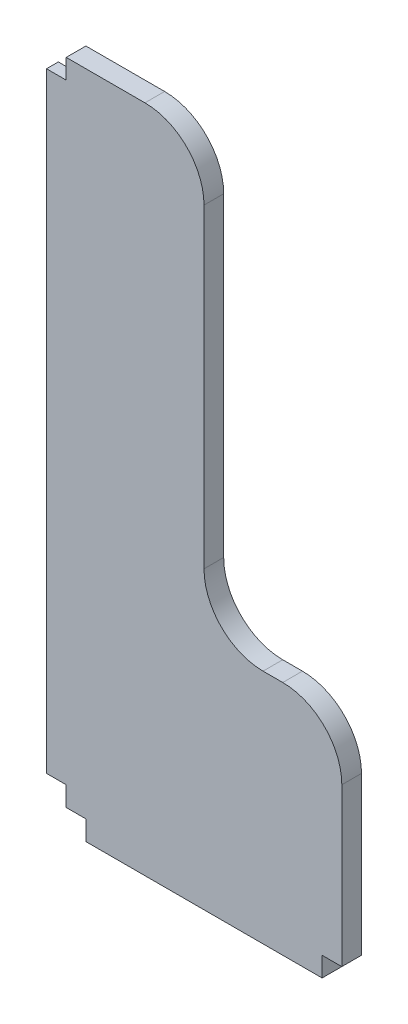
ISO-10303-21;
HEADER;
FILE_DESCRIPTION(('STEP AP214'),'2;1');
FILE_NAME('part.step','',(''),(''),'','','');
FILE_SCHEMA(('AUTOMOTIVE_DESIGN { 1 0 10303 214 1 1 1 1 }'));
ENDSEC;
DATA;
#1=APPLICATION_CONTEXT('core data for automotive mechanical design processes');
#2=APPLICATION_PROTOCOL_DEFINITION('international standard','automotive_design',2000,#1);
#3=PRODUCT_CONTEXT('',#1,'mechanical');
#4=PRODUCT('Part','Part','',(#3));
#5=PRODUCT_RELATED_PRODUCT_CATEGORY('part','',(#4));
#6=PRODUCT_DEFINITION_FORMATION('','',#4);
#7=PRODUCT_DEFINITION_CONTEXT('part definition',#1,'design');
#8=PRODUCT_DEFINITION('design','',#6,#7);
#9=PRODUCT_DEFINITION_SHAPE('','',#8);
#10=(LENGTH_UNIT() NAMED_UNIT(*) SI_UNIT(.MILLI.,.METRE.));
#11=(NAMED_UNIT(*) PLANE_ANGLE_UNIT() SI_UNIT($,.RADIAN.));
#12=(NAMED_UNIT(*) SI_UNIT($,.STERADIAN.) SOLID_ANGLE_UNIT());
#13=UNCERTAINTY_MEASURE_WITH_UNIT(LENGTH_MEASURE(1.E-05),#10,'distance_accuracy_value','');
#14=(GEOMETRIC_REPRESENTATION_CONTEXT(3) GLOBAL_UNCERTAINTY_ASSIGNED_CONTEXT((#13)) GLOBAL_UNIT_ASSIGNED_CONTEXT((#10,
#11,#12)) REPRESENTATION_CONTEXT('',''));
#15=CARTESIAN_POINT('',(0.,0.,0.));
#16=DIRECTION('',(0.,0.,1.));
#17=DIRECTION('',(1.,0.,0.));
#18=AXIS2_PLACEMENT_3D('',#15,#16,#17);
#19=CARTESIAN_POINT('',(25.4,190.5,0.));
#20=DIRECTION('',(0.,0.,-1.));
#21=DIRECTION('',(-1.,0.,0.));
#22=AXIS2_PLACEMENT_3D('',#19,#20,#21);
#23=PLANE('',#22);
#24=DIRECTION('',(1.,0.,0.));
#25=VECTOR('',#24,1.);
#26=CARTESIAN_POINT('',(0.,0.,0.));
#27=LINE('',#26,#25);
#28=CARTESIAN_POINT('',(0.,0.,0.));
#29=VERTEX_POINT('',#28);
#30=CARTESIAN_POINT('',(6.35,0.,0.));
#31=VERTEX_POINT('',#30);
#32=EDGE_CURVE('E182',#29,#31,#27,.T.);
#33=ORIENTED_EDGE('',*,*,#32,.F.);
#34=DIRECTION('',(0.,-1.,0.));
#35=VECTOR('',#34,1.);
#36=CARTESIAN_POINT('',(0.,203.2,0.));
#37=LINE('',#36,#35);
#38=CARTESIAN_POINT('',(0.,209.55,0.));
#39=VERTEX_POINT('',#38);
#40=EDGE_CURVE('E204',#39,#29,#37,.T.);
#41=ORIENTED_EDGE('',*,*,#40,.F.);
#42=DIRECTION('',(-1.,0.,0.));
#43=VECTOR('',#42,1.);
#44=CARTESIAN_POINT('',(0.,209.55,0.));
#45=LINE('',#44,#43);
#46=CARTESIAN_POINT('',(25.3999999999999,209.55,0.));
#47=VERTEX_POINT('',#46);
#48=EDGE_CURVE('E101',#47,#39,#45,.T.);
#49=ORIENTED_EDGE('',*,*,#48,.F.);
#50=CARTESIAN_POINT('',(25.4,190.5,0.));
#51=DIRECTION('',(0.,0.,1.));
#52=DIRECTION('',(-1.,0.,0.));
#53=AXIS2_PLACEMENT_3D('',#50,#51,#52);
#54=CIRCLE('',#53,19.05);
#55=CARTESIAN_POINT('',(44.45,190.5,0.));
#56=VERTEX_POINT('',#55);
#57=EDGE_CURVE('E94',#56,#47,#54,.T.);
#58=ORIENTED_EDGE('',*,*,#57,.F.);
#59=DIRECTION('',(0.,1.,0.));
#60=VECTOR('',#59,1.);
#61=CARTESIAN_POINT('',(44.45,190.5,0.));
#62=LINE('',#61,#60);
#63=CARTESIAN_POINT('',(44.45,88.9000000000001,0.));
#64=VERTEX_POINT('',#63);
#65=EDGE_CURVE('E200',#64,#56,#62,.T.);
#66=ORIENTED_EDGE('',*,*,#65,.F.);
#67=CARTESIAN_POINT('',(63.5,88.9,0.));
#68=DIRECTION('',(0.,0.,-1.));
#69=DIRECTION('',(1.,0.,0.));
#70=AXIS2_PLACEMENT_3D('',#67,#68,#69);
#71=CIRCLE('',#70,19.05);
#72=CARTESIAN_POINT('',(63.5000000000001,69.85,0.));
#73=VERTEX_POINT('',#72);
#74=EDGE_CURVE('E198',#73,#64,#71,.T.);
#75=ORIENTED_EDGE('',*,*,#74,.F.);
#76=DIRECTION('',(-1.,0.,0.));
#77=VECTOR('',#76,1.);
#78=CARTESIAN_POINT('',(63.5000000000001,69.85,0.));
#79=LINE('',#78,#77);
#80=CARTESIAN_POINT('',(69.8499999999999,69.85,0.));
#81=VERTEX_POINT('',#80);
#82=EDGE_CURVE('E196',#81,#73,#79,.T.);
#83=ORIENTED_EDGE('',*,*,#82,.F.);
#84=CARTESIAN_POINT('',(69.85,50.8,0.));
#85=DIRECTION('',(0.,0.,1.));
#86=DIRECTION('',(-1.,0.,0.));
#87=AXIS2_PLACEMENT_3D('',#84,#85,#86);
#88=CIRCLE('',#87,19.05);
#89=CARTESIAN_POINT('',(88.9,50.7999999999999,0.));
#90=VERTEX_POINT('',#89);
#91=EDGE_CURVE('E194',#90,#81,#88,.T.);
#92=ORIENTED_EDGE('',*,*,#91,.F.);
#93=DIRECTION('',(0.,1.,0.));
#94=VECTOR('',#93,1.);
#95=CARTESIAN_POINT('',(88.9,50.7999999999999,0.));
#96=LINE('',#95,#94);
#97=CARTESIAN_POINT('',(88.9,0.,0.));
#98=VERTEX_POINT('',#97);
#99=EDGE_CURVE('E192',#98,#90,#96,.T.);
#100=ORIENTED_EDGE('',*,*,#99,.F.);
#101=DIRECTION('',(1.,0.,0.));
#102=VECTOR('',#101,1.);
#103=CARTESIAN_POINT('',(82.55,0.,0.));
#104=LINE('',#103,#102);
#105=CARTESIAN_POINT('',(82.55,0.,0.));
#106=VERTEX_POINT('',#105);
#107=EDGE_CURVE('E190',#106,#98,#104,.T.);
#108=ORIENTED_EDGE('',*,*,#107,.F.);
#109=DIRECTION('',(0.,1.,0.));
#110=VECTOR('',#109,1.);
#111=CARTESIAN_POINT('',(82.55,-6.35,0.));
#112=LINE('',#111,#110);
#113=CARTESIAN_POINT('',(82.55,-6.35,0.));
#114=VERTEX_POINT('',#113);
#115=EDGE_CURVE('E188',#114,#106,#112,.T.);
#116=ORIENTED_EDGE('',*,*,#115,.F.);
#117=DIRECTION('',(1.,0.,0.));
#118=VECTOR('',#117,1.);
#119=CARTESIAN_POINT('',(6.35,-6.35,0.));
#120=LINE('',#119,#118);
#121=CARTESIAN_POINT('',(6.35,-6.35,0.));
#122=VERTEX_POINT('',#121);
#123=EDGE_CURVE('E186',#122,#114,#120,.T.);
#124=ORIENTED_EDGE('',*,*,#123,.F.);
#125=DIRECTION('',(0.,-1.,0.));
#126=VECTOR('',#125,1.);
#127=CARTESIAN_POINT('',(6.35,0.,0.));
#128=LINE('',#127,#126);
#129=EDGE_CURVE('E184',#31,#122,#128,.T.);
#130=ORIENTED_EDGE('',*,*,#129,.F.);
#131=EDGE_LOOP('',(#33,#41,#49,#58,#66,#75,#83,#92,#100,#108,#116,#124,#130));
#132=FACE_BOUND('',#131,.T.);
#133=ADVANCED_FACE('F32',(#132),#23,.T.);
#134=CARTESIAN_POINT('',(0.,0.,6.35));
#135=DIRECTION('',(0.,1.,0.));
#136=DIRECTION('',(0.,0.,1.));
#137=AXIS2_PLACEMENT_3D('',#134,#135,#136);
#138=PLANE('',#137);
#139=ORIENTED_EDGE('',*,*,#32,.T.);
#140=DIRECTION('',(0.,0.,-1.));
#141=VECTOR('',#140,1.);
#142=CARTESIAN_POINT('',(6.35,0.,6.35));
#143=LINE('',#142,#141);
#144=CARTESIAN_POINT('',(6.35,0.,6.35));
#145=VERTEX_POINT('',#144);
#146=EDGE_CURVE('E41',#145,#31,#143,.T.);
#147=ORIENTED_EDGE('',*,*,#146,.F.);
#148=DIRECTION('',(1.,0.,0.));
#149=VECTOR('',#148,1.);
#150=CARTESIAN_POINT('',(0.,0.,6.35));
#151=LINE('',#150,#149);
#152=CARTESIAN_POINT('',(0.,0.,6.35));
#153=VERTEX_POINT('',#152);
#154=EDGE_CURVE('E109',#153,#145,#151,.T.);
#155=ORIENTED_EDGE('',*,*,#154,.F.);
#156=DIRECTION('',(0.,0.,-1.));
#157=VECTOR('',#156,1.);
#158=CARTESIAN_POINT('',(0.,0.,6.35));
#159=LINE('',#158,#157);
#160=EDGE_CURVE('E11',#153,#29,#159,.T.);
#161=ORIENTED_EDGE('',*,*,#160,.T.);
#162=EDGE_LOOP('',(#139,#147,#155,#161));
#163=FACE_BOUND('',#162,.T.);
#164=ADVANCED_FACE('F34',(#163),#138,.F.);
#165=CARTESIAN_POINT('',(6.35,0.,6.35));
#166=DIRECTION('',(1.,0.,0.));
#167=DIRECTION('',(0.,0.,-1.));
#168=AXIS2_PLACEMENT_3D('',#165,#166,#167);
#169=PLANE('',#168);
#170=ORIENTED_EDGE('',*,*,#129,.T.);
#171=DIRECTION('',(0.,0.,-1.));
#172=VECTOR('',#171,1.);
#173=CARTESIAN_POINT('',(6.35,-6.35,6.35));
#174=LINE('',#173,#172);
#175=CARTESIAN_POINT('',(6.35,-6.35,6.35));
#176=VERTEX_POINT('',#175);
#177=EDGE_CURVE('E238',#176,#122,#174,.T.);
#178=ORIENTED_EDGE('',*,*,#177,.F.);
#179=DIRECTION('',(0.,-1.,0.));
#180=VECTOR('',#179,1.);
#181=CARTESIAN_POINT('',(6.35,0.,6.35));
#182=LINE('',#181,#180);
#183=EDGE_CURVE('E246',#145,#176,#182,.T.);
#184=ORIENTED_EDGE('',*,*,#183,.F.);
#185=ORIENTED_EDGE('',*,*,#146,.T.);
#186=EDGE_LOOP('',(#170,#178,#184,#185));
#187=FACE_BOUND('',#186,.T.);
#188=ADVANCED_FACE('F244',(#187),#169,.F.);
#189=CARTESIAN_POINT('',(6.35,-6.35,6.35));
#190=DIRECTION('',(0.,1.,0.));
#191=DIRECTION('',(0.,0.,1.));
#192=AXIS2_PLACEMENT_3D('',#189,#190,#191);
#193=PLANE('',#192);
#194=ORIENTED_EDGE('',*,*,#123,.T.);
#195=DIRECTION('',(0.,0.,-1.));
#196=VECTOR('',#195,1.);
#197=CARTESIAN_POINT('',(82.55,-6.35,6.35));
#198=LINE('',#197,#196);
#199=CARTESIAN_POINT('',(82.55,-6.35,6.35));
#200=VERTEX_POINT('',#199);
#201=EDGE_CURVE('E235',#200,#114,#198,.T.);
#202=ORIENTED_EDGE('',*,*,#201,.F.);
#203=DIRECTION('',(1.,0.,0.));
#204=VECTOR('',#203,1.);
#205=CARTESIAN_POINT('',(6.35,-6.35,6.35));
#206=LINE('',#205,#204);
#207=EDGE_CURVE('E264',#176,#200,#206,.T.);
#208=ORIENTED_EDGE('',*,*,#207,.F.);
#209=ORIENTED_EDGE('',*,*,#177,.T.);
#210=EDGE_LOOP('',(#194,#202,#208,#209));
#211=FACE_BOUND('',#210,.T.);
#212=ADVANCED_FACE('F255',(#211),#193,.F.);
#213=CARTESIAN_POINT('',(82.55,-6.35,6.35));
#214=DIRECTION('',(-1.,0.,0.));
#215=DIRECTION('',(0.,0.,1.));
#216=AXIS2_PLACEMENT_3D('',#213,#214,#215);
#217=PLANE('',#216);
#218=ORIENTED_EDGE('',*,*,#115,.T.);
#219=DIRECTION('',(0.,0.,-1.));
#220=VECTOR('',#219,1.);
#221=CARTESIAN_POINT('',(82.55,0.,6.35));
#222=LINE('',#221,#220);
#223=CARTESIAN_POINT('',(82.55,0.,6.35));
#224=VERTEX_POINT('',#223);
#225=EDGE_CURVE('E232',#224,#106,#222,.T.);
#226=ORIENTED_EDGE('',*,*,#225,.F.);
#227=DIRECTION('',(0.,1.,0.));
#228=VECTOR('',#227,1.);
#229=CARTESIAN_POINT('',(82.55,-6.35,6.35));
#230=LINE('',#229,#228);
#231=EDGE_CURVE('E261',#200,#224,#230,.T.);
#232=ORIENTED_EDGE('',*,*,#231,.F.);
#233=ORIENTED_EDGE('',*,*,#201,.T.);
#234=EDGE_LOOP('',(#218,#226,#232,#233));
#235=FACE_BOUND('',#234,.T.);
#236=ADVANCED_FACE('F259',(#235),#217,.F.);
#237=CARTESIAN_POINT('',(82.55,0.,6.35));
#238=DIRECTION('',(0.,1.,0.));
#239=DIRECTION('',(0.,0.,1.));
#240=AXIS2_PLACEMENT_3D('',#237,#238,#239);
#241=PLANE('',#240);
#242=ORIENTED_EDGE('',*,*,#107,.T.);
#243=DIRECTION('',(0.,0.,-1.));
#244=VECTOR('',#243,1.);
#245=CARTESIAN_POINT('',(88.9,0.,6.35));
#246=LINE('',#245,#244);
#247=CARTESIAN_POINT('',(88.9,0.,6.35));
#248=VERTEX_POINT('',#247);
#249=EDGE_CURVE('E229',#248,#98,#246,.T.);
#250=ORIENTED_EDGE('',*,*,#249,.F.);
#251=DIRECTION('',(1.,0.,0.));
#252=VECTOR('',#251,1.);
#253=CARTESIAN_POINT('',(82.55,0.,6.35));
#254=LINE('',#253,#252);
#255=EDGE_CURVE('E263',#224,#248,#254,.T.);
#256=ORIENTED_EDGE('',*,*,#255,.F.);
#257=ORIENTED_EDGE('',*,*,#225,.T.);
#258=EDGE_LOOP('',(#242,#250,#256,#257));
#259=FACE_BOUND('',#258,.T.);
#260=ADVANCED_FACE('F355',(#259),#241,.F.);
#261=CARTESIAN_POINT('',(88.9,50.7999999999999,6.35));
#262=DIRECTION('',(-1.,0.,0.));
#263=DIRECTION('',(0.,0.,1.));
#264=AXIS2_PLACEMENT_3D('',#261,#262,#263);
#265=PLANE('',#264);
#266=ORIENTED_EDGE('',*,*,#99,.T.);
#267=DIRECTION('',(0.,0.,-1.));
#268=VECTOR('',#267,1.);
#269=CARTESIAN_POINT('',(88.9,50.7999999999999,6.35));
#270=LINE('',#269,#268);
#271=CARTESIAN_POINT('',(88.9,50.7999999999999,6.35));
#272=VERTEX_POINT('',#271);
#273=EDGE_CURVE('E226',#272,#90,#270,.T.);
#274=ORIENTED_EDGE('',*,*,#273,.F.);
#275=DIRECTION('',(0.,1.,0.));
#276=VECTOR('',#275,1.);
#277=CARTESIAN_POINT('',(88.9,50.7999999999999,6.35));
#278=LINE('',#277,#276);
#279=EDGE_CURVE('E266',#248,#272,#278,.T.);
#280=ORIENTED_EDGE('',*,*,#279,.F.);
#281=ORIENTED_EDGE('',*,*,#249,.T.);
#282=EDGE_LOOP('',(#266,#274,#280,#281));
#283=FACE_BOUND('',#282,.T.);
#284=ADVANCED_FACE('F351',(#283),#265,.F.);
#285=CARTESIAN_POINT('',(69.85,50.8,6.35));
#286=DIRECTION('',(0.,0.,-1.));
#287=DIRECTION('',(-1.,0.,0.));
#288=AXIS2_PLACEMENT_3D('',#285,#286,#287);
#289=CYLINDRICAL_SURFACE('',#288,19.05);
#290=ORIENTED_EDGE('',*,*,#91,.T.);
#291=DIRECTION('',(0.,0.,-1.));
#292=VECTOR('',#291,1.);
#293=CARTESIAN_POINT('',(69.8499999999999,69.85,6.35));
#294=LINE('',#293,#292);
#295=CARTESIAN_POINT('',(69.8499999999999,69.85,6.35));
#296=VERTEX_POINT('',#295);
#297=EDGE_CURVE('E223',#296,#81,#294,.T.);
#298=ORIENTED_EDGE('',*,*,#297,.F.);
#299=CARTESIAN_POINT('',(69.85,50.8,6.35));
#300=DIRECTION('',(0.,0.,1.));
#301=DIRECTION('',(-1.,0.,0.));
#302=AXIS2_PLACEMENT_3D('',#299,#300,#301);
#303=CIRCLE('',#302,19.05);
#304=EDGE_CURVE('E272',#272,#296,#303,.T.);
#305=ORIENTED_EDGE('',*,*,#304,.F.);
#306=ORIENTED_EDGE('',*,*,#273,.T.);
#307=EDGE_LOOP('',(#290,#298,#305,#306));
#308=FACE_BOUND('',#307,.T.);
#309=ADVANCED_FACE('F347',(#308),#289,.T.);
#310=CARTESIAN_POINT('',(63.5000000000001,69.85,6.35));
#311=DIRECTION('',(0.,-1.,0.));
#312=DIRECTION('',(0.,0.,-1.));
#313=AXIS2_PLACEMENT_3D('',#310,#311,#312);
#314=PLANE('',#313);
#315=ORIENTED_EDGE('',*,*,#82,.T.);
#316=DIRECTION('',(0.,0.,-1.));
#317=VECTOR('',#316,1.);
#318=CARTESIAN_POINT('',(63.5000000000001,69.85,6.35));
#319=LINE('',#318,#317);
#320=CARTESIAN_POINT('',(63.5000000000001,69.85,6.35));
#321=VERTEX_POINT('',#320);
#322=EDGE_CURVE('E220',#321,#73,#319,.T.);
#323=ORIENTED_EDGE('',*,*,#322,.F.);
#324=DIRECTION('',(-1.,0.,0.));
#325=VECTOR('',#324,1.);
#326=CARTESIAN_POINT('',(63.5000000000001,69.85,6.35));
#327=LINE('',#326,#325);
#328=EDGE_CURVE('E274',#296,#321,#327,.T.);
#329=ORIENTED_EDGE('',*,*,#328,.F.);
#330=ORIENTED_EDGE('',*,*,#297,.T.);
#331=EDGE_LOOP('',(#315,#323,#329,#330));
#332=FACE_BOUND('',#331,.T.);
#333=ADVANCED_FACE('F343',(#332),#314,.F.);
#334=CARTESIAN_POINT('',(63.5,88.9,6.35));
#335=DIRECTION('',(0.,0.,-1.));
#336=DIRECTION('',(-1.,0.,0.));
#337=AXIS2_PLACEMENT_3D('',#334,#335,#336);
#338=CYLINDRICAL_SURFACE('',#337,19.05);
#339=ORIENTED_EDGE('',*,*,#74,.T.);
#340=DIRECTION('',(0.,0.,-1.));
#341=VECTOR('',#340,1.);
#342=CARTESIAN_POINT('',(44.45,88.9000000000001,6.35));
#343=LINE('',#342,#341);
#344=CARTESIAN_POINT('',(44.45,88.9000000000001,6.35));
#345=VERTEX_POINT('',#344);
#346=EDGE_CURVE('E217',#345,#64,#343,.T.);
#347=ORIENTED_EDGE('',*,*,#346,.F.);
#348=CARTESIAN_POINT('',(63.5,88.9,6.35));
#349=DIRECTION('',(0.,0.,-1.));
#350=DIRECTION('',(1.,0.,0.));
#351=AXIS2_PLACEMENT_3D('',#348,#349,#350);
#352=CIRCLE('',#351,19.05);
#353=EDGE_CURVE('E276',#321,#345,#352,.T.);
#354=ORIENTED_EDGE('',*,*,#353,.F.);
#355=ORIENTED_EDGE('',*,*,#322,.T.);
#356=EDGE_LOOP('',(#339,#347,#354,#355));
#357=FACE_BOUND('',#356,.T.);
#358=ADVANCED_FACE('F339',(#357),#338,.F.);
#359=CARTESIAN_POINT('',(44.45,190.5,6.35));
#360=DIRECTION('',(-1.,0.,0.));
#361=DIRECTION('',(0.,-1.,0.));
#362=AXIS2_PLACEMENT_3D('',#359,#360,#361);
#363=PLANE('',#362);
#364=ORIENTED_EDGE('',*,*,#65,.T.);
#365=DIRECTION('',(0.,0.,-1.));
#366=VECTOR('',#365,1.);
#367=CARTESIAN_POINT('',(44.45,190.5,6.35));
#368=LINE('',#367,#366);
#369=CARTESIAN_POINT('',(44.45,190.5,6.35));
#370=VERTEX_POINT('',#369);
#371=EDGE_CURVE('E215',#370,#56,#368,.T.);
#372=ORIENTED_EDGE('',*,*,#371,.F.);
#373=DIRECTION('',(0.,1.,0.));
#374=VECTOR('',#373,1.);
#375=CARTESIAN_POINT('',(44.45,190.5,6.35));
#376=LINE('',#375,#374);
#377=EDGE_CURVE('E278',#345,#370,#376,.T.);
#378=ORIENTED_EDGE('',*,*,#377,.F.);
#379=ORIENTED_EDGE('',*,*,#346,.T.);
#380=EDGE_LOOP('',(#364,#372,#378,#379));
#381=FACE_BOUND('',#380,.T.);
#382=ADVANCED_FACE('F336',(#381),#363,.F.);
#383=CARTESIAN_POINT('',(25.4,190.5,6.35));
#384=DIRECTION('',(0.,0.,-1.));
#385=DIRECTION('',(-1.,0.,0.));
#386=AXIS2_PLACEMENT_3D('',#383,#384,#385);
#387=CYLINDRICAL_SURFACE('',#386,19.05);
#388=ORIENTED_EDGE('',*,*,#57,.T.);
#389=DIRECTION('',(0.,0.,-1.));
#390=VECTOR('',#389,1.);
#391=CARTESIAN_POINT('',(25.3999999999999,209.55,6.35));
#392=LINE('',#391,#390);
#393=CARTESIAN_POINT('',(25.3999999999999,209.55,6.35));
#394=VERTEX_POINT('',#393);
#395=EDGE_CURVE('E213',#394,#47,#392,.T.);
#396=ORIENTED_EDGE('',*,*,#395,.F.);
#397=CARTESIAN_POINT('',(25.4,190.5,6.35));
#398=DIRECTION('',(0.,0.,1.));
#399=DIRECTION('',(-1.,0.,0.));
#400=AXIS2_PLACEMENT_3D('',#397,#398,#399);
#401=CIRCLE('',#400,19.05);
#402=EDGE_CURVE('E280',#370,#394,#401,.T.);
#403=ORIENTED_EDGE('',*,*,#402,.F.);
#404=ORIENTED_EDGE('',*,*,#371,.T.);
#405=EDGE_LOOP('',(#388,#396,#403,#404));
#406=FACE_BOUND('',#405,.T.);
#407=ADVANCED_FACE('F333',(#406),#387,.T.);
#408=CARTESIAN_POINT('',(0.,209.55,6.35));
#409=DIRECTION('',(0.,-1.,0.));
#410=DIRECTION('',(0.,0.,-1.));
#411=AXIS2_PLACEMENT_3D('',#408,#409,#410);
#412=PLANE('',#411);
#413=ORIENTED_EDGE('',*,*,#48,.T.);
#414=DIRECTION('',(0.,0.,-1.));
#415=VECTOR('',#414,1.);
#416=CARTESIAN_POINT('',(0.,209.55,6.35));
#417=LINE('',#416,#415);
#418=CARTESIAN_POINT('',(0.,209.55,6.35));
#419=VERTEX_POINT('',#418);
#420=EDGE_CURVE('E211',#419,#39,#417,.T.);
#421=ORIENTED_EDGE('',*,*,#420,.F.);
#422=DIRECTION('',(-1.,0.,0.));
#423=VECTOR('',#422,1.);
#424=CARTESIAN_POINT('',(0.,209.55,6.35));
#425=LINE('',#424,#423);
#426=EDGE_CURVE('E282',#394,#419,#425,.T.);
#427=ORIENTED_EDGE('',*,*,#426,.F.);
#428=ORIENTED_EDGE('',*,*,#395,.T.);
#429=EDGE_LOOP('',(#413,#421,#427,#428));
#430=FACE_BOUND('',#429,.T.);
#431=ADVANCED_FACE('F285',(#430),#412,.F.);
#432=CARTESIAN_POINT('',(0.,203.2,6.35));
#433=DIRECTION('',(1.,0.,0.));
#434=DIRECTION('',(0.,0.,-1.));
#435=AXIS2_PLACEMENT_3D('',#432,#433,#434);
#436=PLANE('',#435);
#437=ORIENTED_EDGE('',*,*,#40,.T.);
#438=ORIENTED_EDGE('',*,*,#160,.F.);
#439=DIRECTION('',(0.,-1.,0.));
#440=VECTOR('',#439,1.);
#441=CARTESIAN_POINT('',(0.,0.,6.35));
#442=LINE('',#441,#440);
#443=CARTESIAN_POINT('',(0.,6.35,6.35));
#444=VERTEX_POINT('',#443);
#445=EDGE_CURVE('E206',#444,#153,#442,.T.);
#446=ORIENTED_EDGE('',*,*,#445,.F.);
#447=DIRECTION('',(0.,0.,-1.));
#448=VECTOR('',#447,1.);
#449=CARTESIAN_POINT('',(0.,6.35,6.35));
#450=LINE('',#449,#448);
#451=CARTESIAN_POINT('',(0.,6.35,2.54000000000002));
#452=VERTEX_POINT('',#451);
#453=EDGE_CURVE('E178',#444,#452,#450,.T.);
#454=ORIENTED_EDGE('',*,*,#453,.T.);
#455=DIRECTION('',(0.,1.,0.));
#456=VECTOR('',#455,1.);
#457=CARTESIAN_POINT('',(0.,203.2,2.54));
#458=LINE('',#457,#456);
#459=CARTESIAN_POINT('',(0.,203.2,2.54));
#460=VERTEX_POINT('',#459);
#461=EDGE_CURVE('E290',#452,#460,#458,.T.);
#462=ORIENTED_EDGE('',*,*,#461,.T.);
#463=DIRECTION('',(0.,0.,-1.));
#464=VECTOR('',#463,1.);
#465=CARTESIAN_POINT('',(0.,203.2,6.35));
#466=LINE('',#465,#464);
#467=CARTESIAN_POINT('',(0.,203.2,6.35));
#468=VERTEX_POINT('',#467);
#469=EDGE_CURVE('E172',#468,#460,#466,.T.);
#470=ORIENTED_EDGE('',*,*,#469,.F.);
#471=DIRECTION('',(0.,-1.,0.));
#472=VECTOR('',#471,1.);
#473=CARTESIAN_POINT('',(0.,203.2,6.35));
#474=LINE('',#473,#472);
#475=EDGE_CURVE('E159',#419,#468,#474,.T.);
#476=ORIENTED_EDGE('',*,*,#475,.F.);
#477=ORIENTED_EDGE('',*,*,#420,.T.);
#478=EDGE_LOOP('',(#437,#438,#446,#454,#462,#470,#476,#477));
#479=FACE_BOUND('',#478,.T.);
#480=ADVANCED_FACE('F287',(#479),#436,.F.);
#481=CARTESIAN_POINT('',(-6.35,203.2,6.35));
#482=DIRECTION('',(0.,-1.,0.));
#483=DIRECTION('',(0.,0.,-1.));
#484=AXIS2_PLACEMENT_3D('',#481,#482,#483);
#485=PLANE('',#484);
#486=ORIENTED_EDGE('',*,*,#469,.T.);
#487=DIRECTION('',(-1.,0.,0.));
#488=VECTOR('',#487,1.);
#489=CARTESIAN_POINT('',(0.,203.2,2.54));
#490=LINE('',#489,#488);
#491=CARTESIAN_POINT('',(-6.35,203.2,2.54));
#492=VERTEX_POINT('',#491);
#493=EDGE_CURVE('E169',#460,#492,#490,.T.);
#494=ORIENTED_EDGE('',*,*,#493,.T.);
#495=DIRECTION('',(0.,0.,-1.));
#496=VECTOR('',#495,1.);
#497=CARTESIAN_POINT('',(-6.35,203.2,6.35));
#498=LINE('',#497,#496);
#499=CARTESIAN_POINT('',(-6.35,203.2,6.35));
#500=VERTEX_POINT('',#499);
#501=EDGE_CURVE('E166',#500,#492,#498,.T.);
#502=ORIENTED_EDGE('',*,*,#501,.F.);
#503=DIRECTION('',(-1.,0.,0.));
#504=VECTOR('',#503,1.);
#505=CARTESIAN_POINT('',(-6.35,203.2,6.35));
#506=LINE('',#505,#504);
#507=EDGE_CURVE('E152',#468,#500,#506,.T.);
#508=ORIENTED_EDGE('',*,*,#507,.F.);
#509=EDGE_LOOP('',(#486,#494,#502,#508));
#510=FACE_BOUND('',#509,.T.);
#511=ADVANCED_FACE('F167',(#510),#485,.F.);
#512=CARTESIAN_POINT('',(-6.35,6.35,6.35));
#513=DIRECTION('',(1.,0.,0.));
#514=DIRECTION('',(0.,0.,-1.));
#515=AXIS2_PLACEMENT_3D('',#512,#513,#514);
#516=PLANE('',#515);
#517=ORIENTED_EDGE('',*,*,#501,.T.);
#518=DIRECTION('',(0.,1.,0.));
#519=VECTOR('',#518,1.);
#520=CARTESIAN_POINT('',(-6.35,203.2,2.54));
#521=LINE('',#520,#519);
#522=CARTESIAN_POINT('',(-6.35,6.35,2.54000000000002));
#523=VERTEX_POINT('',#522);
#524=EDGE_CURVE('E300',#523,#492,#521,.T.);
#525=ORIENTED_EDGE('',*,*,#524,.F.);
#526=DIRECTION('',(0.,0.,-1.));
#527=VECTOR('',#526,1.);
#528=CARTESIAN_POINT('',(-6.35,6.35,6.35));
#529=LINE('',#528,#527);
#530=CARTESIAN_POINT('',(-6.35,6.35,6.35));
#531=VERTEX_POINT('',#530);
#532=EDGE_CURVE('E173',#531,#523,#529,.T.);
#533=ORIENTED_EDGE('',*,*,#532,.F.);
#534=DIRECTION('',(0.,-1.,0.));
#535=VECTOR('',#534,1.);
#536=CARTESIAN_POINT('',(-6.35,6.35,6.35));
#537=LINE('',#536,#535);
#538=EDGE_CURVE('E156',#500,#531,#537,.T.);
#539=ORIENTED_EDGE('',*,*,#538,.F.);
#540=EDGE_LOOP('',(#517,#525,#533,#539));
#541=FACE_BOUND('',#540,.T.);
#542=ADVANCED_FACE('F175',(#541),#516,.F.);
#543=CARTESIAN_POINT('',(0.,6.35,6.35));
#544=DIRECTION('',(0.,1.,0.));
#545=DIRECTION('',(-1.,0.,0.));
#546=AXIS2_PLACEMENT_3D('',#543,#544,#545);
#547=PLANE('',#546);
#548=ORIENTED_EDGE('',*,*,#532,.T.);
#549=DIRECTION('',(-1.,0.,0.));
#550=VECTOR('',#549,1.);
#551=CARTESIAN_POINT('',(0.,6.35,2.54000000000002));
#552=LINE('',#551,#550);
#553=EDGE_CURVE('E299',#452,#523,#552,.T.);
#554=ORIENTED_EDGE('',*,*,#553,.F.);
#555=ORIENTED_EDGE('',*,*,#453,.F.);
#556=DIRECTION('',(1.,0.,0.));
#557=VECTOR('',#556,1.);
#558=CARTESIAN_POINT('',(0.,6.35,6.35));
#559=LINE('',#558,#557);
#560=EDGE_CURVE('E49',#531,#444,#559,.T.);
#561=ORIENTED_EDGE('',*,*,#560,.F.);
#562=EDGE_LOOP('',(#548,#554,#555,#561));
#563=FACE_BOUND('',#562,.T.);
#564=ADVANCED_FACE('F321',(#563),#547,.F.);
#565=CARTESIAN_POINT('',(25.4,190.5,6.35));
#566=DIRECTION('',(0.,0.,-1.));
#567=DIRECTION('',(-1.,0.,0.));
#568=AXIS2_PLACEMENT_3D('',#565,#566,#567);
#569=PLANE('',#568);
#570=ORIENTED_EDGE('',*,*,#445,.T.);
#571=ORIENTED_EDGE('',*,*,#154,.T.);
#572=ORIENTED_EDGE('',*,*,#183,.T.);
#573=ORIENTED_EDGE('',*,*,#207,.T.);
#574=ORIENTED_EDGE('',*,*,#231,.T.);
#575=ORIENTED_EDGE('',*,*,#255,.T.);
#576=ORIENTED_EDGE('',*,*,#279,.T.);
#577=ORIENTED_EDGE('',*,*,#304,.T.);
#578=ORIENTED_EDGE('',*,*,#328,.T.);
#579=ORIENTED_EDGE('',*,*,#353,.T.);
#580=ORIENTED_EDGE('',*,*,#377,.T.);
#581=ORIENTED_EDGE('',*,*,#402,.T.);
#582=ORIENTED_EDGE('',*,*,#426,.T.);
#583=ORIENTED_EDGE('',*,*,#475,.T.);
#584=ORIENTED_EDGE('',*,*,#507,.T.);
#585=ORIENTED_EDGE('',*,*,#538,.T.);
#586=ORIENTED_EDGE('',*,*,#560,.T.);
#587=EDGE_LOOP('',(#570,#571,#572,#573,#574,#575,#576,#577,#578,#579,#580,#581,#582,#583,#584,
#585,#586));
#588=FACE_BOUND('',#587,.T.);
#589=ADVANCED_FACE('F154',(#588),#569,.F.);
#590=CARTESIAN_POINT('',(0.,203.2,2.54));
#591=DIRECTION('',(0.,0.,1.));
#592=DIRECTION('',(0.,-1.,0.));
#593=AXIS2_PLACEMENT_3D('',#590,#591,#592);
#594=PLANE('',#593);
#595=ORIENTED_EDGE('',*,*,#524,.T.);
#596=ORIENTED_EDGE('',*,*,#493,.F.);
#597=ORIENTED_EDGE('',*,*,#461,.F.);
#598=ORIENTED_EDGE('',*,*,#553,.T.);
#599=EDGE_LOOP('',(#595,#596,#597,#598));
#600=FACE_BOUND('',#599,.T.);
#601=ADVANCED_FACE('F301',(#600),#594,.F.);
#602=CLOSED_SHELL('',(#133,#164,#188,#212,#236,#260,#284,#309,#333,#358,#382,#407,#431,#480,
#511,#542,#564,#589,#601));
#603=MANIFOLD_SOLID_BREP('B2',#602);
#604=ADVANCED_BREP_SHAPE_REPRESENTATION('',(#18,#603),#14);
#605=SHAPE_DEFINITION_REPRESENTATION(#9,#604);
ENDSEC;
END-ISO-10303-21;
